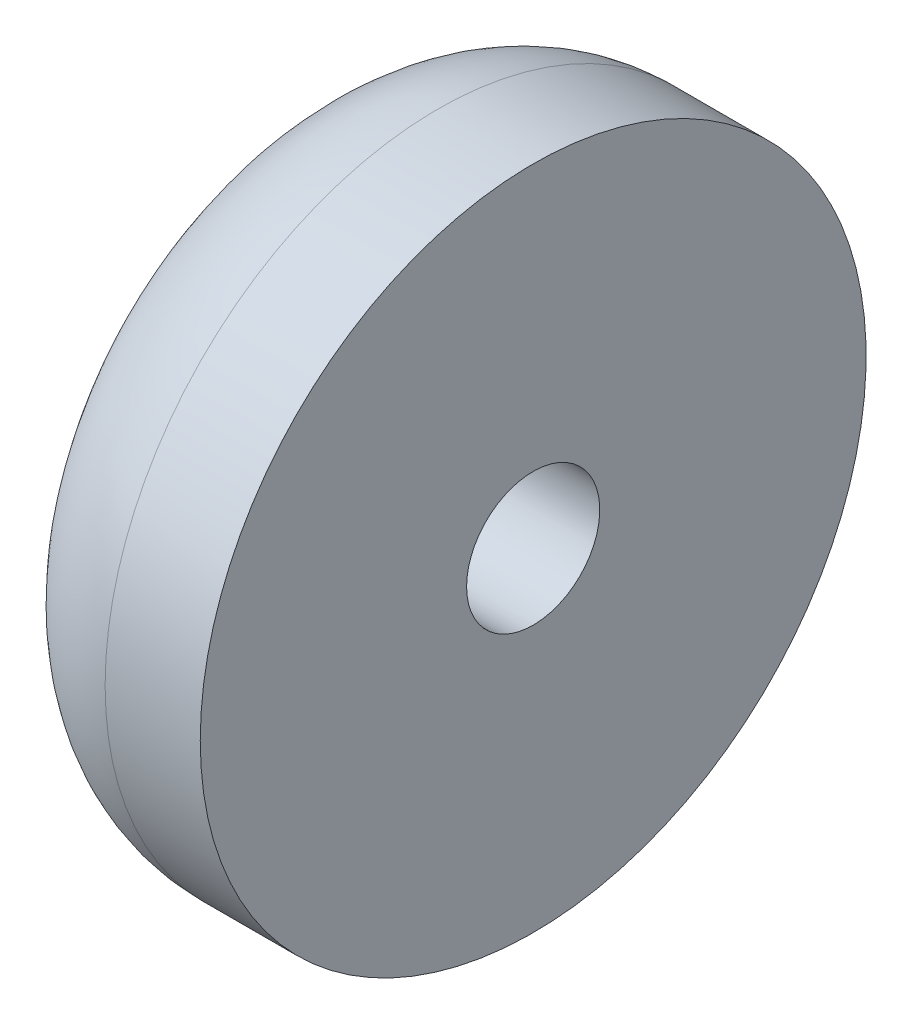
ISO-10303-21;
HEADER;
FILE_DESCRIPTION(('STEP AP214'),'2;1');
FILE_NAME('part.step','',(''),(''),'','','');
FILE_SCHEMA(('AUTOMOTIVE_DESIGN { 1 0 10303 214 1 1 1 1 }'));
ENDSEC;
DATA;
#1=APPLICATION_CONTEXT('core data for automotive mechanical design processes');
#2=APPLICATION_PROTOCOL_DEFINITION('international standard','automotive_design',2000,#1);
#3=PRODUCT_CONTEXT('',#1,'mechanical');
#4=PRODUCT('Part','Part','',(#3));
#5=PRODUCT_RELATED_PRODUCT_CATEGORY('part','',(#4));
#6=PRODUCT_DEFINITION_FORMATION('','',#4);
#7=PRODUCT_DEFINITION_CONTEXT('part definition',#1,'design');
#8=PRODUCT_DEFINITION('design','',#6,#7);
#9=PRODUCT_DEFINITION_SHAPE('','',#8);
#10=(LENGTH_UNIT() NAMED_UNIT(*) SI_UNIT(.MILLI.,.METRE.));
#11=(NAMED_UNIT(*) PLANE_ANGLE_UNIT() SI_UNIT($,.RADIAN.));
#12=(NAMED_UNIT(*) SI_UNIT($,.STERADIAN.) SOLID_ANGLE_UNIT());
#13=UNCERTAINTY_MEASURE_WITH_UNIT(LENGTH_MEASURE(1.E-05),#10,'distance_accuracy_value','');
#14=(GEOMETRIC_REPRESENTATION_CONTEXT(3) GLOBAL_UNCERTAINTY_ASSIGNED_CONTEXT((#13)) GLOBAL_UNIT_ASSIGNED_CONTEXT((#10,
#11,#12)) REPRESENTATION_CONTEXT('',''));
#15=CARTESIAN_POINT('',(0.,0.,0.));
#16=DIRECTION('',(0.,0.,1.));
#17=DIRECTION('',(1.,0.,0.));
#18=AXIS2_PLACEMENT_3D('',#15,#16,#17);
#19=CARTESIAN_POINT('',(-34.169607513477,31.0636668384129,65.25));
#20=DIRECTION('',(1.,0.,0.));
#21=DIRECTION('',(0.,0.,-1.));
#22=AXIS2_PLACEMENT_3D('',#19,#20,#21);
#23=CYLINDRICAL_SURFACE('',#22,1.4);
#24=CARTESIAN_POINT('',(-29.169607513477,31.0636668384129,65.25));
#25=DIRECTION('',(-1.,0.,0.));
#26=DIRECTION('',(0.,0.,1.));
#27=AXIS2_PLACEMENT_3D('',#24,#25,#26);
#28=CIRCLE('',#27,1.4);
#29=CARTESIAN_POINT('',(-29.169607513477,31.0636668384129,66.65));
#30=VERTEX_POINT('',#29);
#31=EDGE_CURVE('E47',#30,#30,#28,.T.);
#32=ORIENTED_EDGE('',*,*,#31,.F.);
#33=EDGE_LOOP('',(#32));
#34=FACE_BOUND('',#33,.T.);
#35=CARTESIAN_POINT('',(-31.169607513477,31.0636668384129,65.25));
#36=DIRECTION('',(-1.,0.,0.));
#37=DIRECTION('',(0.,0.,1.));
#38=AXIS2_PLACEMENT_3D('',#35,#36,#37);
#39=CIRCLE('',#38,1.4);
#40=CARTESIAN_POINT('',(-31.169607513477,31.0636668384129,66.65));
#41=VERTEX_POINT('',#40);
#42=EDGE_CURVE('E34',#41,#41,#39,.T.);
#43=ORIENTED_EDGE('',*,*,#42,.T.);
#44=EDGE_LOOP('',(#43));
#45=FACE_BOUND('',#44,.T.);
#46=ADVANCED_FACE('F30',(#34,#45),#23,.F.);
#47=CARTESIAN_POINT('',(-34.169607513477,31.0636668384129,65.25));
#48=DIRECTION('',(-1.,0.,0.));
#49=DIRECTION('',(0.,0.,1.));
#50=AXIS2_PLACEMENT_3D('',#47,#48,#49);
#51=PLANE('',#50);
#52=CARTESIAN_POINT('',(-34.169607513477,31.0636668384129,65.25));
#53=DIRECTION('',(-1.,0.,0.));
#54=DIRECTION('',(0.,0.,1.));
#55=AXIS2_PLACEMENT_3D('',#52,#53,#54);
#56=CIRCLE('',#55,3.00000000000001);
#57=CARTESIAN_POINT('',(-34.169607513477,31.0636668384129,68.25));
#58=VERTEX_POINT('',#57);
#59=EDGE_CURVE('E50',#58,#58,#56,.T.);
#60=ORIENTED_EDGE('',*,*,#59,.F.);
#61=EDGE_LOOP('',(#60));
#62=FACE_BOUND('',#61,.T.);
#63=CARTESIAN_POINT('',(-34.169607513477,31.0636668384129,65.25));
#64=DIRECTION('',(-1.,0.,0.));
#65=DIRECTION('',(0.,0.,1.));
#66=AXIS2_PLACEMENT_3D('',#63,#64,#65);
#67=CIRCLE('',#66,4.);
#68=CARTESIAN_POINT('',(-34.169607513477,31.0636668384129,69.25));
#69=VERTEX_POINT('',#68);
#70=EDGE_CURVE('E38',#69,#69,#67,.T.);
#71=ORIENTED_EDGE('',*,*,#70,.T.);
#72=EDGE_LOOP('',(#71));
#73=FACE_BOUND('',#72,.T.);
#74=ADVANCED_FACE('F71',(#62,#73),#51,.T.);
#75=CARTESIAN_POINT('',(-29.169607513477,31.0636668384129,65.25));
#76=DIRECTION('',(-1.,0.,0.));
#77=DIRECTION('',(0.,0.,1.));
#78=AXIS2_PLACEMENT_3D('',#75,#76,#77);
#79=PLANE('',#78);
#80=CARTESIAN_POINT('',(-29.169607513477,31.0636668384129,65.25));
#81=DIRECTION('',(-1.,0.,0.));
#82=DIRECTION('',(0.,0.,1.));
#83=AXIS2_PLACEMENT_3D('',#80,#81,#82);
#84=CIRCLE('',#83,7.);
#85=CARTESIAN_POINT('',(-29.169607513477,31.0636668384129,72.25));
#86=VERTEX_POINT('',#85);
#87=EDGE_CURVE('E42',#86,#86,#84,.T.);
#88=ORIENTED_EDGE('',*,*,#87,.F.);
#89=EDGE_LOOP('',(#88));
#90=FACE_BOUND('',#89,.T.);
#91=ORIENTED_EDGE('',*,*,#31,.T.);
#92=EDGE_LOOP('',(#91));
#93=FACE_BOUND('',#92,.T.);
#94=ADVANCED_FACE('F77',(#90,#93),#79,.F.);
#95=CARTESIAN_POINT('',(-34.169607513477,31.0636668384129,65.25));
#96=DIRECTION('',(1.,0.,0.));
#97=DIRECTION('',(0.,0.,-1.));
#98=AXIS2_PLACEMENT_3D('',#95,#96,#97);
#99=CYLINDRICAL_SURFACE('',#98,7.);
#100=CARTESIAN_POINT('',(-31.169607513477,31.0636668384129,65.25));
#101=DIRECTION('',(-1.,0.,0.));
#102=DIRECTION('',(0.,0.,1.));
#103=AXIS2_PLACEMENT_3D('',#100,#101,#102);
#104=CIRCLE('',#103,7.);
#105=CARTESIAN_POINT('',(-31.169607513477,31.0636668384129,72.25));
#106=VERTEX_POINT('',#105);
#107=EDGE_CURVE('E10',#106,#106,#104,.F.);
#108=ORIENTED_EDGE('',*,*,#107,.T.);
#109=EDGE_LOOP('',(#108));
#110=FACE_BOUND('',#109,.T.);
#111=ORIENTED_EDGE('',*,*,#87,.T.);
#112=EDGE_LOOP('',(#111));
#113=FACE_BOUND('',#112,.T.);
#114=ADVANCED_FACE('F83',(#110,#113),#99,.T.);
#115=CARTESIAN_POINT('',(-31.169607513477,31.0636668384129,65.25));
#116=DIRECTION('',(-1.,0.,0.));
#117=DIRECTION('',(0.,0.,1.));
#118=AXIS2_PLACEMENT_3D('',#115,#116,#117);
#119=TOROIDAL_SURFACE('',#118,4.,3.);
#120=ORIENTED_EDGE('',*,*,#107,.F.);
#121=EDGE_LOOP('',(#120));
#122=FACE_BOUND('',#121,.T.);
#123=ORIENTED_EDGE('',*,*,#70,.F.);
#124=EDGE_LOOP('',(#123));
#125=FACE_BOUND('',#124,.T.);
#126=ADVANCED_FACE('F32',(#122,#125),#119,.T.);
#127=CARTESIAN_POINT('',(-31.169607513477,31.0636668384129,65.25));
#128=DIRECTION('',(-1.,0.,0.));
#129=DIRECTION('',(0.,0.,1.));
#130=AXIS2_PLACEMENT_3D('',#127,#128,#129);
#131=CYLINDRICAL_SURFACE('',#130,3.00000000000001);
#132=CARTESIAN_POINT('',(-31.169607513477,31.0636668384129,65.25));
#133=DIRECTION('',(-1.,0.,0.));
#134=DIRECTION('',(0.,0.,1.));
#135=AXIS2_PLACEMENT_3D('',#132,#133,#134);
#136=CIRCLE('',#135,3.00000000000001);
#137=CARTESIAN_POINT('',(-31.169607513477,31.0636668384129,68.25));
#138=VERTEX_POINT('',#137);
#139=EDGE_CURVE('E53',#138,#138,#136,.T.);
#140=ORIENTED_EDGE('',*,*,#139,.F.);
#141=EDGE_LOOP('',(#140));
#142=FACE_BOUND('',#141,.T.);
#143=ORIENTED_EDGE('',*,*,#59,.T.);
#144=EDGE_LOOP('',(#143));
#145=FACE_BOUND('',#144,.T.);
#146=ADVANCED_FACE('F63',(#142,#145),#131,.F.);
#147=CARTESIAN_POINT('',(-31.169607513477,31.0636668384129,65.25));
#148=DIRECTION('',(-1.,0.,0.));
#149=DIRECTION('',(0.,0.,1.));
#150=AXIS2_PLACEMENT_3D('',#147,#148,#149);
#151=PLANE('',#150);
#152=ORIENTED_EDGE('',*,*,#42,.F.);
#153=EDGE_LOOP('',(#152));
#154=FACE_BOUND('',#153,.T.);
#155=ORIENTED_EDGE('',*,*,#139,.T.);
#156=EDGE_LOOP('',(#155));
#157=FACE_BOUND('',#156,.T.);
#158=ADVANCED_FACE('F61',(#154,#157),#151,.T.);
#159=CLOSED_SHELL('',(#46,#74,#94,#114,#126,#146,#158));
#160=MANIFOLD_SOLID_BREP('B2',#159);
#161=ADVANCED_BREP_SHAPE_REPRESENTATION('',(#18,#160),#14);
#162=SHAPE_DEFINITION_REPRESENTATION(#9,#161);
ENDSEC;
END-ISO-10303-21;
